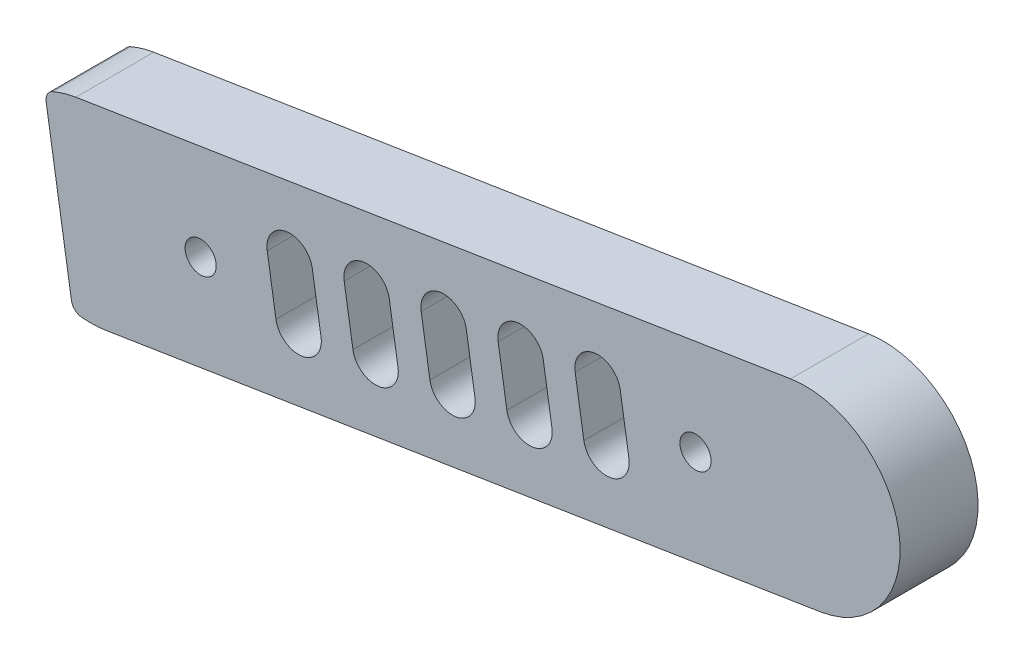
ISO-10303-21;
HEADER;
FILE_DESCRIPTION(('STEP AP214'),'2;1');
FILE_NAME('part.step','',(''),(''),'','','');
FILE_SCHEMA(('AUTOMOTIVE_DESIGN { 1 0 10303 214 1 1 1 1 }'));
ENDSEC;
DATA;
#1=APPLICATION_CONTEXT('core data for automotive mechanical design processes');
#2=APPLICATION_PROTOCOL_DEFINITION('international standard','automotive_design',2000,#1);
#3=PRODUCT_CONTEXT('',#1,'mechanical');
#4=PRODUCT('Part','Part','',(#3));
#5=PRODUCT_RELATED_PRODUCT_CATEGORY('part','',(#4));
#6=PRODUCT_DEFINITION_FORMATION('','',#4);
#7=PRODUCT_DEFINITION_CONTEXT('part definition',#1,'design');
#8=PRODUCT_DEFINITION('design','',#6,#7);
#9=PRODUCT_DEFINITION_SHAPE('','',#8);
#10=(LENGTH_UNIT() NAMED_UNIT(*) SI_UNIT(.MILLI.,.METRE.));
#11=(NAMED_UNIT(*) PLANE_ANGLE_UNIT() SI_UNIT($,.RADIAN.));
#12=(NAMED_UNIT(*) SI_UNIT($,.STERADIAN.) SOLID_ANGLE_UNIT());
#13=UNCERTAINTY_MEASURE_WITH_UNIT(LENGTH_MEASURE(1.E-05),#10,'distance_accuracy_value','');
#14=(GEOMETRIC_REPRESENTATION_CONTEXT(3) GLOBAL_UNCERTAINTY_ASSIGNED_CONTEXT((#13)) GLOBAL_UNIT_ASSIGNED_CONTEXT((#10,
#11,#12)) REPRESENTATION_CONTEXT('',''));
#15=CARTESIAN_POINT('',(0.,0.,0.));
#16=DIRECTION('',(0.,0.,1.));
#17=DIRECTION('',(1.,0.,0.));
#18=AXIS2_PLACEMENT_3D('',#15,#16,#17);
#19=CARTESIAN_POINT('',(-40.7231386420232,49.2227181202242,7.));
#20=DIRECTION('',(0.,0.,1.));
#21=DIRECTION('',(1.,0.,0.));
#22=AXIS2_PLACEMENT_3D('',#19,#20,#21);
#23=PLANE('',#22);
#24=CARTESIAN_POINT('',(-30.8468715609134,50.7909491435711,7.));
#25=DIRECTION('',(0.,0.,1.));
#26=DIRECTION('',(1.,0.,0.));
#27=AXIS2_PLACEMENT_3D('',#24,#25,#26);
#28=CIRCLE('',#27,1.4);
#29=CARTESIAN_POINT('',(-29.4468715609134,50.7909491435711,7.));
#30=VERTEX_POINT('',#29);
#31=EDGE_CURVE('E386',#30,#30,#28,.T.);
#32=ORIENTED_EDGE('',*,*,#31,.F.);
#33=EDGE_LOOP('',(#32));
#34=FACE_BOUND('',#33,.T.);
#35=CARTESIAN_POINT('',(-40.7231386420232,49.2227181202242,7.));
#36=DIRECTION('',(0.,0.,1.));
#37=DIRECTION('',(1.,0.,0.));
#38=AXIS2_PLACEMENT_3D('',#35,#36,#37);
#39=CIRCLE('',#38,8.49999999999936);
#40=CARTESIAN_POINT('',(-42.0561350118685,57.6175451391668,7.));
#41=VERTEX_POINT('',#40);
#42=CARTESIAN_POINT('',(-44.1393409125393,57.0060054749934,7.));
#43=VERTEX_POINT('',#42);
#44=EDGE_CURVE('E392',#41,#43,#39,.T.);
#45=ORIENTED_EDGE('',*,*,#44,.T.);
#46=CARTESIAN_POINT('',(-43.7374347630668,56.0903246097263,7.));
#47=DIRECTION('',(0.,0.,1.));
#48=DIRECTION('',(1.,0.,0.));
#49=AXIS2_PLACEMENT_3D('',#46,#47,#48);
#50=CIRCLE('',#49,1.00000000000001);
#51=CARTESIAN_POINT('',(-44.7250614711778,55.9335015073916,7.));
#52=VERTEX_POINT('',#51);
#53=EDGE_CURVE('E395',#43,#52,#50,.T.);
#54=ORIENTED_EDGE('',*,*,#53,.T.);
#55=DIRECTION('',(0.156823102334758,-0.987626708110965,0.));
#56=VECTOR('',#55,1.);
#57=CARTESIAN_POINT('',(-44.7250614711778,55.9335015073916,7.));
#58=LINE('',#57,#56);
#59=CARTESIAN_POINT('',(-42.4494507199119,41.602360739514,7.));
#60=VERTEX_POINT('',#59);
#61=EDGE_CURVE('E398',#52,#60,#58,.T.);
#62=ORIENTED_EDGE('',*,*,#61,.T.);
#63=CARTESIAN_POINT('',(-41.4618240118009,41.7591838418487,7.));
#64=DIRECTION('',(0.,0.,1.));
#65=DIRECTION('',(-1.,0.,0.));
#66=AXIS2_PLACEMENT_3D('',#63,#64,#65);
#67=CIRCLE('',#66,0.999999999999996);
#68=CARTESIAN_POINT('',(-41.560315394438,40.7640459380654,7.));
#69=VERTEX_POINT('',#68);
#70=EDGE_CURVE('E400',#60,#69,#67,.T.);
#71=ORIENTED_EDGE('',*,*,#70,.T.);
#72=CARTESIAN_POINT('',(-40.723138642023,49.2227181202194,7.));
#73=DIRECTION('',(0.,0.,1.));
#74=DIRECTION('',(-1.,0.,0.));
#75=AXIS2_PLACEMENT_3D('',#72,#73,#74);
#76=CIRCLE('',#75,8.49999999999588);
#77=CARTESIAN_POINT('',(-39.3901422721777,40.8278911012804,7.));
#78=VERTEX_POINT('',#77);
#79=EDGE_CURVE('E402',#69,#78,#76,.T.);
#80=ORIENTED_EDGE('',*,*,#79,.T.);
#81=DIRECTION('',(0.987626708110965,0.156823102334758,0.));
#82=VECTOR('',#81,1.);
#83=CARTESIAN_POINT('',(24.8055937550351,51.0213927530396,7.));
#84=LINE('',#83,#82);
#85=CARTESIAN_POINT('',(24.8055937550351,51.0213927530396,7.));
#86=VERTEX_POINT('',#85);
#87=EDGE_CURVE('E404',#78,#86,#84,.T.);
#88=ORIENTED_EDGE('',*,*,#87,.T.);
#89=CARTESIAN_POINT('',(23.4725973851897,59.4162197719828,7.));
#90=DIRECTION('',(0.,0.,1.));
#91=DIRECTION('',(-1.,0.,0.));
#92=AXIS2_PLACEMENT_3D('',#89,#90,#91);
#93=CIRCLE('',#92,8.50000000000001);
#94=CARTESIAN_POINT('',(22.1396010153443,67.811046790926,7.));
#95=VERTEX_POINT('',#94);
#96=EDGE_CURVE('E406',#86,#95,#93,.T.);
#97=ORIENTED_EDGE('',*,*,#96,.T.);
#98=DIRECTION('',(-0.987626708110965,-0.156823102334758,0.));
#99=VECTOR('',#98,1.);
#100=CARTESIAN_POINT('',(-42.0561350118685,57.6175451391668,7.));
#101=LINE('',#100,#99);
#102=EDGE_CURVE('E408',#95,#41,#101,.T.);
#103=ORIENTED_EDGE('',*,*,#102,.T.);
#104=EDGE_LOOP('',(#45,#54,#62,#71,#80,#88,#97,#103));
#105=FACE_BOUND('',#104,.T.);
#106=CARTESIAN_POINT('',(13.59633030408,57.8479887486353,7.));
#107=DIRECTION('',(0.,0.,1.));
#108=DIRECTION('',(1.,0.,0.));
#109=AXIS2_PLACEMENT_3D('',#106,#107,#108);
#110=CIRCLE('',#109,1.4);
#111=CARTESIAN_POINT('',(14.99633030408,57.8479887486353,7.));
#112=VERTEX_POINT('',#111);
#113=EDGE_CURVE('E380',#112,#112,#110,.T.);
#114=ORIENTED_EDGE('',*,*,#113,.F.);
#115=EDGE_LOOP('',(#114));
#116=FACE_BOUND('',#115,.T.);
#117=DIRECTION('',(0.156823102334757,-0.987626708110965,0.));
#118=VECTOR('',#117,1.);
#119=CARTESIAN_POINT('',(2.78481077766739,58.6625717892804,7.));
#120=LINE('',#119,#118);
#121=CARTESIAN_POINT('',(2.78481077766739,58.6625717892804,7.));
#122=VERTEX_POINT('',#121);
#123=CARTESIAN_POINT('',(3.56892628934118,53.7244382487256,7.));
#124=VERTEX_POINT('',#123);
#125=EDGE_CURVE('E351',#122,#124,#120,.T.);
#126=ORIENTED_EDGE('',*,*,#125,.F.);
#127=CARTESIAN_POINT('',(4.80944552929487,58.9840591490667,7.));
#128=DIRECTION('',(0.,0.,1.));
#129=DIRECTION('',(1.,0.,0.));
#130=AXIS2_PLACEMENT_3D('',#127,#128,#129);
#131=CIRCLE('',#130,2.05);
#132=CARTESIAN_POINT('',(6.83408028092235,59.305546508853,7.));
#133=VERTEX_POINT('',#132);
#134=EDGE_CURVE('E349',#133,#122,#131,.T.);
#135=ORIENTED_EDGE('',*,*,#134,.F.);
#136=DIRECTION('',(-0.156823102334755,0.987626708110966,0.));
#137=VECTOR('',#136,1.);
#138=CARTESIAN_POINT('',(6.83408028092235,59.305546508853,7.));
#139=LINE('',#138,#137);
#140=CARTESIAN_POINT('',(7.61819579259613,54.3674129682981,7.));
#141=VERTEX_POINT('',#140);
#142=EDGE_CURVE('E357',#141,#133,#139,.T.);
#143=ORIENTED_EDGE('',*,*,#142,.F.);
#144=CARTESIAN_POINT('',(5.59356104096865,54.0459256085119,7.));
#145=DIRECTION('',(0.,0.,1.));
#146=DIRECTION('',(1.,0.,0.));
#147=AXIS2_PLACEMENT_3D('',#144,#145,#146);
#148=CIRCLE('',#147,2.05);
#149=EDGE_CURVE('E354',#124,#141,#148,.T.);
#150=ORIENTED_EDGE('',*,*,#149,.F.);
#151=EDGE_LOOP('',(#126,#135,#143,#150));
#152=FACE_BOUND('',#151,.T.);
#153=DIRECTION('',(0.156823102334757,-0.987626708110965,0.));
#154=VECTOR('',#153,1.);
#155=CARTESIAN_POINT('',(-4.12857617910944,57.5648100729376,7.));
#156=LINE('',#155,#154);
#157=CARTESIAN_POINT('',(-4.12857617910944,57.5648100729376,7.));
#158=VERTEX_POINT('',#157);
#159=CARTESIAN_POINT('',(-3.34446066743565,52.6266765323828,7.));
#160=VERTEX_POINT('',#159);
#161=EDGE_CURVE('E320',#158,#160,#156,.T.);
#162=ORIENTED_EDGE('',*,*,#161,.F.);
#163=CARTESIAN_POINT('',(-2.10394142748196,57.8862974327238,7.));
#164=DIRECTION('',(0.,0.,1.));
#165=DIRECTION('',(1.,0.,0.));
#166=AXIS2_PLACEMENT_3D('',#163,#164,#165);
#167=CIRCLE('',#166,2.05);
#168=CARTESIAN_POINT('',(-0.0793066758544752,58.2077847925101,7.));
#169=VERTEX_POINT('',#168);
#170=EDGE_CURVE('E318',#169,#158,#167,.T.);
#171=ORIENTED_EDGE('',*,*,#170,.F.);
#172=DIRECTION('',(-0.156823102334755,0.987626708110966,0.));
#173=VECTOR('',#172,1.);
#174=CARTESIAN_POINT('',(-0.0793066758544752,58.2077847925101,7.));
#175=LINE('',#174,#173);
#176=CARTESIAN_POINT('',(0.704808835819294,53.2696512519553,7.));
#177=VERTEX_POINT('',#176);
#178=EDGE_CURVE('E326',#177,#169,#175,.T.);
#179=ORIENTED_EDGE('',*,*,#178,.F.);
#180=CARTESIAN_POINT('',(-1.31982591580818,52.948163892169,7.));
#181=DIRECTION('',(0.,0.,1.));
#182=DIRECTION('',(1.,0.,0.));
#183=AXIS2_PLACEMENT_3D('',#180,#181,#182);
#184=CIRCLE('',#183,2.05);
#185=EDGE_CURVE('E323',#160,#177,#184,.T.);
#186=ORIENTED_EDGE('',*,*,#185,.F.);
#187=EDGE_LOOP('',(#162,#171,#179,#186));
#188=FACE_BOUND('',#187,.T.);
#189=DIRECTION('',(0.156823102334757,-0.987626708110965,0.));
#190=VECTOR('',#189,1.);
#191=CARTESIAN_POINT('',(-11.0419631358863,56.4670483565948,7.));
#192=LINE('',#191,#190);
#193=CARTESIAN_POINT('',(-11.0419631358863,56.4670483565948,7.));
#194=VERTEX_POINT('',#193);
#195=CARTESIAN_POINT('',(-10.2578476242125,51.5289148160399,7.));
#196=VERTEX_POINT('',#195);
#197=EDGE_CURVE('E289',#194,#196,#192,.T.);
#198=ORIENTED_EDGE('',*,*,#197,.F.);
#199=CARTESIAN_POINT('',(-9.01732838425879,56.788535716381,7.));
#200=DIRECTION('',(0.,0.,1.));
#201=DIRECTION('',(1.,0.,0.));
#202=AXIS2_PLACEMENT_3D('',#199,#200,#201);
#203=CIRCLE('',#202,2.05);
#204=CARTESIAN_POINT('',(-6.99269363263131,57.1100230761673,7.));
#205=VERTEX_POINT('',#204);
#206=EDGE_CURVE('E287',#205,#194,#203,.T.);
#207=ORIENTED_EDGE('',*,*,#206,.F.);
#208=DIRECTION('',(-0.156823102334755,0.987626708110966,0.));
#209=VECTOR('',#208,1.);
#210=CARTESIAN_POINT('',(-6.99269363263131,57.1100230761673,7.));
#211=LINE('',#210,#209);
#212=CARTESIAN_POINT('',(-6.20857812095753,52.1718895356124,7.));
#213=VERTEX_POINT('',#212);
#214=EDGE_CURVE('E295',#213,#205,#211,.T.);
#215=ORIENTED_EDGE('',*,*,#214,.F.);
#216=CARTESIAN_POINT('',(-8.23321287258501,51.8504021758262,7.));
#217=DIRECTION('',(0.,0.,1.));
#218=DIRECTION('',(1.,0.,0.));
#219=AXIS2_PLACEMENT_3D('',#216,#217,#218);
#220=CIRCLE('',#219,2.05);
#221=EDGE_CURVE('E292',#196,#213,#220,.T.);
#222=ORIENTED_EDGE('',*,*,#221,.F.);
#223=EDGE_LOOP('',(#198,#207,#215,#222));
#224=FACE_BOUND('',#223,.T.);
#225=DIRECTION('',(0.156823102334757,-0.987626708110965,0.));
#226=VECTOR('',#225,1.);
#227=CARTESIAN_POINT('',(-17.9553500926631,55.3692866402519,7.));
#228=LINE('',#227,#226);
#229=CARTESIAN_POINT('',(-17.9553500926631,55.3692866402519,7.));
#230=VERTEX_POINT('',#229);
#231=CARTESIAN_POINT('',(-17.1712345809893,50.4311530996971,7.));
#232=VERTEX_POINT('',#231);
#233=EDGE_CURVE('E258',#230,#232,#228,.T.);
#234=ORIENTED_EDGE('',*,*,#233,.F.);
#235=CARTESIAN_POINT('',(-15.9307153410356,55.6907740000381,7.));
#236=DIRECTION('',(0.,0.,1.));
#237=DIRECTION('',(1.,0.,0.));
#238=AXIS2_PLACEMENT_3D('',#235,#236,#237);
#239=CIRCLE('',#238,2.05);
#240=CARTESIAN_POINT('',(-13.9060805894081,56.0122613598244,7.));
#241=VERTEX_POINT('',#240);
#242=EDGE_CURVE('E256',#241,#230,#239,.T.);
#243=ORIENTED_EDGE('',*,*,#242,.F.);
#244=DIRECTION('',(-0.156823102334755,0.987626708110966,0.));
#245=VECTOR('',#244,1.);
#246=CARTESIAN_POINT('',(-13.9060805894081,56.0122613598244,7.));
#247=LINE('',#246,#245);
#248=CARTESIAN_POINT('',(-13.1219650777344,51.0741278192696,7.));
#249=VERTEX_POINT('',#248);
#250=EDGE_CURVE('E264',#249,#241,#247,.T.);
#251=ORIENTED_EDGE('',*,*,#250,.F.);
#252=CARTESIAN_POINT('',(-15.1465998293618,50.7526404594833,7.));
#253=DIRECTION('',(0.,0.,1.));
#254=DIRECTION('',(1.,0.,0.));
#255=AXIS2_PLACEMENT_3D('',#252,#253,#254);
#256=CIRCLE('',#255,2.05);
#257=EDGE_CURVE('E261',#232,#249,#256,.T.);
#258=ORIENTED_EDGE('',*,*,#257,.F.);
#259=EDGE_LOOP('',(#234,#243,#251,#258));
#260=FACE_BOUND('',#259,.T.);
#261=DIRECTION('',(0.156823102334757,-0.987626708110965,0.));
#262=VECTOR('',#261,1.);
#263=CARTESIAN_POINT('',(-24.8687370494399,54.2715249239091,7.));
#264=LINE('',#263,#262);
#265=CARTESIAN_POINT('',(-24.8687370494399,54.2715249239091,7.));
#266=VERTEX_POINT('',#265);
#267=CARTESIAN_POINT('',(-24.0846215377661,49.3333913833542,7.));
#268=VERTEX_POINT('',#267);
#269=EDGE_CURVE('E228',#266,#268,#264,.T.);
#270=ORIENTED_EDGE('',*,*,#269,.F.);
#271=CARTESIAN_POINT('',(-22.8441022978124,54.5930122836953,7.));
#272=DIRECTION('',(0.,0.,1.));
#273=DIRECTION('',(1.,0.,0.));
#274=AXIS2_PLACEMENT_3D('',#271,#272,#273);
#275=CIRCLE('',#274,2.05);
#276=CARTESIAN_POINT('',(-20.819467546185,54.9144996434816,7.));
#277=VERTEX_POINT('',#276);
#278=EDGE_CURVE('E220',#277,#266,#275,.T.);
#279=ORIENTED_EDGE('',*,*,#278,.F.);
#280=DIRECTION('',(-0.156823102334755,0.987626708110966,0.));
#281=VECTOR('',#280,1.);
#282=CARTESIAN_POINT('',(-20.819467546185,54.9144996434816,7.));
#283=LINE('',#282,#281);
#284=CARTESIAN_POINT('',(-20.0353520345112,49.9763661029267,7.));
#285=VERTEX_POINT('',#284);
#286=EDGE_CURVE('E242',#285,#277,#283,.T.);
#287=ORIENTED_EDGE('',*,*,#286,.F.);
#288=CARTESIAN_POINT('',(-22.0599867861387,49.6548787431405,7.));
#289=DIRECTION('',(0.,0.,1.));
#290=DIRECTION('',(1.,0.,0.));
#291=AXIS2_PLACEMENT_3D('',#288,#289,#290);
#292=CIRCLE('',#291,2.05);
#293=EDGE_CURVE('E240',#268,#285,#292,.T.);
#294=ORIENTED_EDGE('',*,*,#293,.F.);
#295=EDGE_LOOP('',(#270,#279,#287,#294));
#296=FACE_BOUND('',#295,.T.);
#297=ADVANCED_FACE('F35',(#34,#105,#116,#152,#188,#224,#260,#296),#23,.T.);
#298=CARTESIAN_POINT('',(-40.7231386420232,49.2227181202242,0.));
#299=DIRECTION('',(0.,0.,1.));
#300=DIRECTION('',(1.,0.,0.));
#301=AXIS2_PLACEMENT_3D('',#298,#299,#300);
#302=PLANE('',#301);
#303=CARTESIAN_POINT('',(-15.9307153410356,55.6907740000381,0.));
#304=DIRECTION('',(0.,0.,1.));
#305=DIRECTION('',(1.,0.,0.));
#306=AXIS2_PLACEMENT_3D('',#303,#304,#305);
#307=CIRCLE('',#306,2.05);
#308=CARTESIAN_POINT('',(-13.9060805894081,56.0122613598244,0.));
#309=VERTEX_POINT('',#308);
#310=CARTESIAN_POINT('',(-17.9553500926631,55.3692866402519,0.));
#311=VERTEX_POINT('',#310);
#312=EDGE_CURVE('E236',#309,#311,#307,.T.);
#313=ORIENTED_EDGE('',*,*,#312,.T.);
#314=DIRECTION('',(0.156823102334757,-0.987626708110965,0.));
#315=VECTOR('',#314,1.);
#316=CARTESIAN_POINT('',(-17.9553500926631,55.3692866402519,0.));
#317=LINE('',#316,#315);
#318=CARTESIAN_POINT('',(-17.1712345809893,50.4311530996971,0.));
#319=VERTEX_POINT('',#318);
#320=EDGE_CURVE('E269',#311,#319,#317,.T.);
#321=ORIENTED_EDGE('',*,*,#320,.T.);
#322=CARTESIAN_POINT('',(-15.1465998293618,50.7526404594833,0.));
#323=DIRECTION('',(0.,0.,1.));
#324=DIRECTION('',(1.,0.,0.));
#325=AXIS2_PLACEMENT_3D('',#322,#323,#324);
#326=CIRCLE('',#325,2.05);
#327=CARTESIAN_POINT('',(-13.1219650777344,51.0741278192696,0.));
#328=VERTEX_POINT('',#327);
#329=EDGE_CURVE('E272',#319,#328,#326,.T.);
#330=ORIENTED_EDGE('',*,*,#329,.T.);
#331=DIRECTION('',(-0.156823102334755,0.987626708110966,0.));
#332=VECTOR('',#331,1.);
#333=CARTESIAN_POINT('',(-13.9060805894081,56.0122613598244,0.));
#334=LINE('',#333,#332);
#335=EDGE_CURVE('E259',#328,#309,#334,.T.);
#336=ORIENTED_EDGE('',*,*,#335,.T.);
#337=EDGE_LOOP('',(#313,#321,#330,#336));
#338=FACE_BOUND('',#337,.T.);
#339=CARTESIAN_POINT('',(-2.10394142748196,57.8862974327238,0.));
#340=DIRECTION('',(0.,0.,1.));
#341=DIRECTION('',(1.,0.,0.));
#342=AXIS2_PLACEMENT_3D('',#339,#340,#341);
#343=CIRCLE('',#342,2.05);
#344=CARTESIAN_POINT('',(-0.079306675854479,58.2077847925101,0.));
#345=VERTEX_POINT('',#344);
#346=CARTESIAN_POINT('',(-4.12857617910944,57.5648100729376,0.));
#347=VERTEX_POINT('',#346);
#348=EDGE_CURVE('E317',#345,#347,#343,.T.);
#349=ORIENTED_EDGE('',*,*,#348,.T.);
#350=DIRECTION('',(0.156823102334757,-0.987626708110965,0.));
#351=VECTOR('',#350,1.);
#352=CARTESIAN_POINT('',(-4.12857617910944,57.5648100729376,0.));
#353=LINE('',#352,#351);
#354=CARTESIAN_POINT('',(-3.34446066743565,52.6266765323828,0.));
#355=VERTEX_POINT('',#354);
#356=EDGE_CURVE('E331',#347,#355,#353,.T.);
#357=ORIENTED_EDGE('',*,*,#356,.T.);
#358=CARTESIAN_POINT('',(-1.31982591580818,52.948163892169,0.));
#359=DIRECTION('',(0.,0.,1.));
#360=DIRECTION('',(1.,0.,0.));
#361=AXIS2_PLACEMENT_3D('',#358,#359,#360);
#362=CIRCLE('',#361,2.05);
#363=CARTESIAN_POINT('',(0.704808835819297,53.2696512519553,0.));
#364=VERTEX_POINT('',#363);
#365=EDGE_CURVE('E334',#355,#364,#362,.T.);
#366=ORIENTED_EDGE('',*,*,#365,.T.);
#367=DIRECTION('',(-0.156823102334755,0.987626708110966,0.));
#368=VECTOR('',#367,1.);
#369=CARTESIAN_POINT('',(-0.0793066758544752,58.2077847925101,0.));
#370=LINE('',#369,#368);
#371=EDGE_CURVE('E321',#364,#345,#370,.T.);
#372=ORIENTED_EDGE('',*,*,#371,.T.);
#373=EDGE_LOOP('',(#349,#357,#366,#372));
#374=FACE_BOUND('',#373,.T.);
#375=CARTESIAN_POINT('',(13.59633030408,57.8479887486353,0.));
#376=DIRECTION('',(0.,0.,1.));
#377=DIRECTION('',(1.,0.,0.));
#378=AXIS2_PLACEMENT_3D('',#375,#376,#377);
#379=CIRCLE('',#378,1.4);
#380=CARTESIAN_POINT('',(14.99633030408,57.8479887486353,0.));
#381=VERTEX_POINT('',#380);
#382=EDGE_CURVE('E379',#381,#381,#379,.T.);
#383=ORIENTED_EDGE('',*,*,#382,.T.);
#384=EDGE_LOOP('',(#383));
#385=FACE_BOUND('',#384,.T.);
#386=CARTESIAN_POINT('',(-30.8468715609134,50.7909491435711,0.));
#387=DIRECTION('',(0.,0.,1.));
#388=DIRECTION('',(1.,0.,0.));
#389=AXIS2_PLACEMENT_3D('',#386,#387,#388);
#390=CIRCLE('',#389,1.4);
#391=CARTESIAN_POINT('',(-29.4468715609134,50.7909491435711,0.));
#392=VERTEX_POINT('',#391);
#393=EDGE_CURVE('E383',#392,#392,#390,.T.);
#394=ORIENTED_EDGE('',*,*,#393,.T.);
#395=EDGE_LOOP('',(#394));
#396=FACE_BOUND('',#395,.T.);
#397=CARTESIAN_POINT('',(-40.7231386420232,49.2227181202242,0.));
#398=DIRECTION('',(0.,0.,1.));
#399=DIRECTION('',(1.,0.,0.));
#400=AXIS2_PLACEMENT_3D('',#397,#398,#399);
#401=CIRCLE('',#400,8.49999999999936);
#402=CARTESIAN_POINT('',(-42.0561350118685,57.6175451391668,0.));
#403=VERTEX_POINT('',#402);
#404=CARTESIAN_POINT('',(-44.1393409125393,57.0060054749934,0.));
#405=VERTEX_POINT('',#404);
#406=EDGE_CURVE('E389',#403,#405,#401,.T.);
#407=ORIENTED_EDGE('',*,*,#406,.F.);
#408=DIRECTION('',(-0.987626708110965,-0.156823102334758,0.));
#409=VECTOR('',#408,1.);
#410=CARTESIAN_POINT('',(-42.0561350118685,57.6175451391668,0.));
#411=LINE('',#410,#409);
#412=CARTESIAN_POINT('',(22.1396010153443,67.811046790926,0.));
#413=VERTEX_POINT('',#412);
#414=EDGE_CURVE('E396',#413,#403,#411,.T.);
#415=ORIENTED_EDGE('',*,*,#414,.F.);
#416=CARTESIAN_POINT('',(23.4725973851897,59.4162197719828,0.));
#417=DIRECTION('',(0.,0.,1.));
#418=DIRECTION('',(-1.,0.,0.));
#419=AXIS2_PLACEMENT_3D('',#416,#417,#418);
#420=CIRCLE('',#419,8.50000000000001);
#421=CARTESIAN_POINT('',(24.8055937550351,51.0213927530396,0.));
#422=VERTEX_POINT('',#421);
#423=EDGE_CURVE('E423',#422,#413,#420,.T.);
#424=ORIENTED_EDGE('',*,*,#423,.F.);
#425=DIRECTION('',(0.987626708110965,0.156823102334758,0.));
#426=VECTOR('',#425,1.);
#427=CARTESIAN_POINT('',(24.8055937550351,51.0213927530396,0.));
#428=LINE('',#427,#426);
#429=CARTESIAN_POINT('',(-39.3901422721777,40.8278911012804,0.));
#430=VERTEX_POINT('',#429);
#431=EDGE_CURVE('E421',#430,#422,#428,.T.);
#432=ORIENTED_EDGE('',*,*,#431,.F.);
#433=CARTESIAN_POINT('',(-40.723138642023,49.2227181202194,0.));
#434=DIRECTION('',(0.,0.,1.));
#435=DIRECTION('',(-1.,0.,0.));
#436=AXIS2_PLACEMENT_3D('',#433,#434,#435);
#437=CIRCLE('',#436,8.49999999999588);
#438=CARTESIAN_POINT('',(-41.560315394438,40.7640459380654,0.));
#439=VERTEX_POINT('',#438);
#440=EDGE_CURVE('E419',#439,#430,#437,.T.);
#441=ORIENTED_EDGE('',*,*,#440,.F.);
#442=CARTESIAN_POINT('',(-41.4618240118009,41.7591838418487,0.));
#443=DIRECTION('',(0.,0.,1.));
#444=DIRECTION('',(-1.,0.,0.));
#445=AXIS2_PLACEMENT_3D('',#442,#443,#444);
#446=CIRCLE('',#445,0.999999999999996);
#447=CARTESIAN_POINT('',(-42.4494507199119,41.602360739514,0.));
#448=VERTEX_POINT('',#447);
#449=EDGE_CURVE('E417',#448,#439,#446,.T.);
#450=ORIENTED_EDGE('',*,*,#449,.F.);
#451=DIRECTION('',(0.156823102334758,-0.987626708110965,0.));
#452=VECTOR('',#451,1.);
#453=CARTESIAN_POINT('',(-44.7250614711778,55.9335015073916,0.));
#454=LINE('',#453,#452);
#455=CARTESIAN_POINT('',(-44.7250614711778,55.9335015073916,0.));
#456=VERTEX_POINT('',#455);
#457=EDGE_CURVE('E415',#456,#448,#454,.T.);
#458=ORIENTED_EDGE('',*,*,#457,.F.);
#459=CARTESIAN_POINT('',(-43.7374347630668,56.0903246097263,0.));
#460=DIRECTION('',(0.,0.,1.));
#461=DIRECTION('',(1.,0.,0.));
#462=AXIS2_PLACEMENT_3D('',#459,#460,#461);
#463=CIRCLE('',#462,1.00000000000001);
#464=EDGE_CURVE('E413',#405,#456,#463,.T.);
#465=ORIENTED_EDGE('',*,*,#464,.F.);
#466=EDGE_LOOP('',(#407,#415,#424,#432,#441,#450,#458,#465));
#467=FACE_BOUND('',#466,.T.);
#468=CARTESIAN_POINT('',(4.80944552929487,58.9840591490667,0.));
#469=DIRECTION('',(0.,0.,1.));
#470=DIRECTION('',(1.,0.,0.));
#471=AXIS2_PLACEMENT_3D('',#468,#469,#470);
#472=CIRCLE('',#471,2.05);
#473=CARTESIAN_POINT('',(6.83408028092235,59.305546508853,0.));
#474=VERTEX_POINT('',#473);
#475=CARTESIAN_POINT('',(2.78481077766739,58.6625717892804,0.));
#476=VERTEX_POINT('',#475);
#477=EDGE_CURVE('E348',#474,#476,#472,.T.);
#478=ORIENTED_EDGE('',*,*,#477,.T.);
#479=DIRECTION('',(0.156823102334757,-0.987626708110965,0.));
#480=VECTOR('',#479,1.);
#481=CARTESIAN_POINT('',(2.78481077766739,58.6625717892804,0.));
#482=LINE('',#481,#480);
#483=CARTESIAN_POINT('',(3.56892628934118,53.7244382487256,0.));
#484=VERTEX_POINT('',#483);
#485=EDGE_CURVE('E362',#476,#484,#482,.T.);
#486=ORIENTED_EDGE('',*,*,#485,.T.);
#487=CARTESIAN_POINT('',(5.59356104096865,54.0459256085119,0.));
#488=DIRECTION('',(0.,0.,1.));
#489=DIRECTION('',(1.,0.,0.));
#490=AXIS2_PLACEMENT_3D('',#487,#488,#489);
#491=CIRCLE('',#490,2.05);
#492=CARTESIAN_POINT('',(7.61819579259613,54.3674129682981,0.));
#493=VERTEX_POINT('',#492);
#494=EDGE_CURVE('E365',#484,#493,#491,.T.);
#495=ORIENTED_EDGE('',*,*,#494,.T.);
#496=DIRECTION('',(-0.156823102334755,0.987626708110966,0.));
#497=VECTOR('',#496,1.);
#498=CARTESIAN_POINT('',(6.83408028092235,59.305546508853,0.));
#499=LINE('',#498,#497);
#500=EDGE_CURVE('E352',#493,#474,#499,.T.);
#501=ORIENTED_EDGE('',*,*,#500,.T.);
#502=EDGE_LOOP('',(#478,#486,#495,#501));
#503=FACE_BOUND('',#502,.T.);
#504=CARTESIAN_POINT('',(-9.01732838425879,56.788535716381,0.));
#505=DIRECTION('',(0.,0.,1.));
#506=DIRECTION('',(1.,0.,0.));
#507=AXIS2_PLACEMENT_3D('',#504,#505,#506);
#508=CIRCLE('',#507,2.05);
#509=CARTESIAN_POINT('',(-6.9926936326313,57.1100230761673,0.));
#510=VERTEX_POINT('',#509);
#511=CARTESIAN_POINT('',(-11.0419631358863,56.4670483565948,0.));
#512=VERTEX_POINT('',#511);
#513=EDGE_CURVE('E286',#510,#512,#508,.T.);
#514=ORIENTED_EDGE('',*,*,#513,.T.);
#515=DIRECTION('',(0.156823102334757,-0.987626708110965,0.));
#516=VECTOR('',#515,1.);
#517=CARTESIAN_POINT('',(-11.0419631358863,56.4670483565948,0.));
#518=LINE('',#517,#516);
#519=CARTESIAN_POINT('',(-10.2578476242125,51.5289148160399,0.));
#520=VERTEX_POINT('',#519);
#521=EDGE_CURVE('E300',#512,#520,#518,.T.);
#522=ORIENTED_EDGE('',*,*,#521,.T.);
#523=CARTESIAN_POINT('',(-8.23321287258501,51.8504021758262,0.));
#524=DIRECTION('',(0.,0.,1.));
#525=DIRECTION('',(1.,0.,0.));
#526=AXIS2_PLACEMENT_3D('',#523,#524,#525);
#527=CIRCLE('',#526,2.05);
#528=CARTESIAN_POINT('',(-6.20857812095753,52.1718895356124,0.));
#529=VERTEX_POINT('',#528);
#530=EDGE_CURVE('E303',#520,#529,#527,.T.);
#531=ORIENTED_EDGE('',*,*,#530,.T.);
#532=DIRECTION('',(-0.156823102334755,0.987626708110966,0.));
#533=VECTOR('',#532,1.);
#534=CARTESIAN_POINT('',(-6.99269363263131,57.1100230761673,0.));
#535=LINE('',#534,#533);
#536=EDGE_CURVE('E290',#529,#510,#535,.T.);
#537=ORIENTED_EDGE('',*,*,#536,.T.);
#538=EDGE_LOOP('',(#514,#522,#531,#537));
#539=FACE_BOUND('',#538,.T.);
#540=CARTESIAN_POINT('',(-22.8441022978124,54.5930122836953,0.));
#541=DIRECTION('',(0.,0.,1.));
#542=DIRECTION('',(1.,0.,0.));
#543=AXIS2_PLACEMENT_3D('',#540,#541,#542);
#544=CIRCLE('',#543,2.05);
#545=CARTESIAN_POINT('',(-20.819467546185,54.9144996434816,0.));
#546=VERTEX_POINT('',#545);
#547=CARTESIAN_POINT('',(-24.8687370494399,54.2715249239091,0.));
#548=VERTEX_POINT('',#547);
#549=EDGE_CURVE('E58',#546,#548,#544,.T.);
#550=ORIENTED_EDGE('',*,*,#549,.T.);
#551=DIRECTION('',(0.156823102334757,-0.987626708110965,0.));
#552=VECTOR('',#551,1.);
#553=CARTESIAN_POINT('',(-24.8687370494399,54.2715249239091,0.));
#554=LINE('',#553,#552);
#555=CARTESIAN_POINT('',(-24.0846215377661,49.3333913833542,0.));
#556=VERTEX_POINT('',#555);
#557=EDGE_CURVE('E235',#548,#556,#554,.T.);
#558=ORIENTED_EDGE('',*,*,#557,.T.);
#559=CARTESIAN_POINT('',(-22.0599867861387,49.6548787431405,0.));
#560=DIRECTION('',(0.,0.,1.));
#561=DIRECTION('',(1.,0.,0.));
#562=AXIS2_PLACEMENT_3D('',#559,#560,#561);
#563=CIRCLE('',#562,2.05);
#564=CARTESIAN_POINT('',(-20.0353520345112,49.9763661029267,0.));
#565=VERTEX_POINT('',#564);
#566=EDGE_CURVE('E248',#556,#565,#563,.T.);
#567=ORIENTED_EDGE('',*,*,#566,.T.);
#568=DIRECTION('',(-0.156823102334755,0.987626708110966,0.));
#569=VECTOR('',#568,1.);
#570=CARTESIAN_POINT('',(-20.819467546185,54.9144996434816,0.));
#571=LINE('',#570,#569);
#572=EDGE_CURVE('E229',#565,#546,#571,.T.);
#573=ORIENTED_EDGE('',*,*,#572,.T.);
#574=EDGE_LOOP('',(#550,#558,#567,#573));
#575=FACE_BOUND('',#574,.T.);
#576=ADVANCED_FACE('F453',(#338,#374,#385,#396,#467,#503,#539,#575),#302,.F.);
#577=CARTESIAN_POINT('',(-40.7231386420232,49.2227181202242,7.));
#578=DIRECTION('',(0.,0.,-1.));
#579=DIRECTION('',(-1.,0.,0.));
#580=AXIS2_PLACEMENT_3D('',#577,#578,#579);
#581=CYLINDRICAL_SURFACE('',#580,8.49999999999936);
#582=ORIENTED_EDGE('',*,*,#406,.T.);
#583=DIRECTION('',(0.,0.,-1.));
#584=VECTOR('',#583,1.);
#585=CARTESIAN_POINT('',(-44.1393409125393,57.0060054749934,7.));
#586=LINE('',#585,#584);
#587=EDGE_CURVE('E11',#43,#405,#586,.T.);
#588=ORIENTED_EDGE('',*,*,#587,.F.);
#589=ORIENTED_EDGE('',*,*,#44,.F.);
#590=DIRECTION('',(0.,0.,-1.));
#591=VECTOR('',#590,1.);
#592=CARTESIAN_POINT('',(-42.0561350118685,57.6175451391668,7.));
#593=LINE('',#592,#591);
#594=EDGE_CURVE('E410',#41,#403,#593,.T.);
#595=ORIENTED_EDGE('',*,*,#594,.T.);
#596=EDGE_LOOP('',(#582,#588,#589,#595));
#597=FACE_BOUND('',#596,.T.);
#598=ADVANCED_FACE('F37',(#597),#581,.T.);
#599=CARTESIAN_POINT('',(-43.7374347630668,56.0903246097263,7.));
#600=DIRECTION('',(0.,0.,-1.));
#601=DIRECTION('',(-1.,0.,0.));
#602=AXIS2_PLACEMENT_3D('',#599,#600,#601);
#603=CYLINDRICAL_SURFACE('',#602,1.00000000000001);
#604=ORIENTED_EDGE('',*,*,#464,.T.);
#605=DIRECTION('',(0.,0.,-1.));
#606=VECTOR('',#605,1.);
#607=CARTESIAN_POINT('',(-44.7250614711778,55.9335015073916,7.));
#608=LINE('',#607,#606);
#609=EDGE_CURVE('E43',#52,#456,#608,.T.);
#610=ORIENTED_EDGE('',*,*,#609,.F.);
#611=ORIENTED_EDGE('',*,*,#53,.F.);
#612=ORIENTED_EDGE('',*,*,#587,.T.);
#613=EDGE_LOOP('',(#604,#610,#611,#612));
#614=FACE_BOUND('',#613,.T.);
#615=ADVANCED_FACE('F471',(#614),#603,.T.);
#616=CARTESIAN_POINT('',(-44.7250614711778,55.9335015073916,7.));
#617=DIRECTION('',(0.987626708110965,0.156823102334758,0.));
#618=DIRECTION('',(-0.156823102334758,0.987626708110966,0.));
#619=AXIS2_PLACEMENT_3D('',#616,#617,#618);
#620=PLANE('',#619);
#621=ORIENTED_EDGE('',*,*,#457,.T.);
#622=DIRECTION('',(0.,0.,-1.));
#623=VECTOR('',#622,1.);
#624=CARTESIAN_POINT('',(-42.4494507199119,41.602360739514,7.));
#625=LINE('',#624,#623);
#626=EDGE_CURVE('E440',#60,#448,#625,.T.);
#627=ORIENTED_EDGE('',*,*,#626,.F.);
#628=ORIENTED_EDGE('',*,*,#61,.F.);
#629=ORIENTED_EDGE('',*,*,#609,.T.);
#630=EDGE_LOOP('',(#621,#627,#628,#629));
#631=FACE_BOUND('',#630,.T.);
#632=ADVANCED_FACE('F447',(#631),#620,.F.);
#633=CARTESIAN_POINT('',(-41.4618240118009,41.7591838418487,7.));
#634=DIRECTION('',(0.,0.,-1.));
#635=DIRECTION('',(-1.,0.,0.));
#636=AXIS2_PLACEMENT_3D('',#633,#634,#635);
#637=CYLINDRICAL_SURFACE('',#636,0.999999999999996);
#638=ORIENTED_EDGE('',*,*,#449,.T.);
#639=DIRECTION('',(0.,0.,-1.));
#640=VECTOR('',#639,1.);
#641=CARTESIAN_POINT('',(-41.560315394438,40.7640459380654,7.));
#642=LINE('',#641,#640);
#643=EDGE_CURVE('E437',#69,#439,#642,.T.);
#644=ORIENTED_EDGE('',*,*,#643,.F.);
#645=ORIENTED_EDGE('',*,*,#70,.F.);
#646=ORIENTED_EDGE('',*,*,#626,.T.);
#647=EDGE_LOOP('',(#638,#644,#645,#646));
#648=FACE_BOUND('',#647,.T.);
#649=ADVANCED_FACE('F459',(#648),#637,.T.);
#650=CARTESIAN_POINT('',(-40.723138642023,49.2227181202194,7.));
#651=DIRECTION('',(0.,0.,-1.));
#652=DIRECTION('',(-1.,0.,0.));
#653=AXIS2_PLACEMENT_3D('',#650,#651,#652);
#654=CYLINDRICAL_SURFACE('',#653,8.49999999999588);
#655=ORIENTED_EDGE('',*,*,#440,.T.);
#656=DIRECTION('',(0.,0.,-1.));
#657=VECTOR('',#656,1.);
#658=CARTESIAN_POINT('',(-39.3901422721777,40.8278911012804,7.));
#659=LINE('',#658,#657);
#660=EDGE_CURVE('E434',#78,#430,#659,.T.);
#661=ORIENTED_EDGE('',*,*,#660,.F.);
#662=ORIENTED_EDGE('',*,*,#79,.F.);
#663=ORIENTED_EDGE('',*,*,#643,.T.);
#664=EDGE_LOOP('',(#655,#661,#662,#663));
#665=FACE_BOUND('',#664,.T.);
#666=ADVANCED_FACE('F463',(#665),#654,.T.);
#667=CARTESIAN_POINT('',(24.8055937550351,51.0213927530396,7.));
#668=DIRECTION('',(-0.156823102334758,0.987626708110965,0.));
#669=DIRECTION('',(-0.987626708110966,-0.156823102334758,0.));
#670=AXIS2_PLACEMENT_3D('',#667,#668,#669);
#671=PLANE('',#670);
#672=ORIENTED_EDGE('',*,*,#431,.T.);
#673=DIRECTION('',(0.,0.,-1.));
#674=VECTOR('',#673,1.);
#675=CARTESIAN_POINT('',(24.8055937550351,51.0213927530396,7.));
#676=LINE('',#675,#674);
#677=EDGE_CURVE('E431',#86,#422,#676,.T.);
#678=ORIENTED_EDGE('',*,*,#677,.F.);
#679=ORIENTED_EDGE('',*,*,#87,.F.);
#680=ORIENTED_EDGE('',*,*,#660,.T.);
#681=EDGE_LOOP('',(#672,#678,#679,#680));
#682=FACE_BOUND('',#681,.T.);
#683=ADVANCED_FACE('F484',(#682),#671,.F.);
#684=CARTESIAN_POINT('',(23.4725973851897,59.4162197719828,7.));
#685=DIRECTION('',(0.,0.,-1.));
#686=DIRECTION('',(-1.,0.,0.));
#687=AXIS2_PLACEMENT_3D('',#684,#685,#686);
#688=CYLINDRICAL_SURFACE('',#687,8.50000000000001);
#689=ORIENTED_EDGE('',*,*,#423,.T.);
#690=DIRECTION('',(0.,0.,-1.));
#691=VECTOR('',#690,1.);
#692=CARTESIAN_POINT('',(22.1396010153443,67.811046790926,7.));
#693=LINE('',#692,#691);
#694=EDGE_CURVE('E428',#95,#413,#693,.T.);
#695=ORIENTED_EDGE('',*,*,#694,.F.);
#696=ORIENTED_EDGE('',*,*,#96,.F.);
#697=ORIENTED_EDGE('',*,*,#677,.T.);
#698=EDGE_LOOP('',(#689,#695,#696,#697));
#699=FACE_BOUND('',#698,.T.);
#700=ADVANCED_FACE('F482',(#699),#688,.T.);
#701=CARTESIAN_POINT('',(-42.0561350118685,57.6175451391668,7.));
#702=DIRECTION('',(0.156823102334758,-0.987626708110965,0.));
#703=DIRECTION('',(0.987626708110966,0.156823102334758,0.));
#704=AXIS2_PLACEMENT_3D('',#701,#702,#703);
#705=PLANE('',#704);
#706=ORIENTED_EDGE('',*,*,#414,.T.);
#707=ORIENTED_EDGE('',*,*,#594,.F.);
#708=ORIENTED_EDGE('',*,*,#102,.F.);
#709=ORIENTED_EDGE('',*,*,#694,.T.);
#710=EDGE_LOOP('',(#706,#707,#708,#709));
#711=FACE_BOUND('',#710,.T.);
#712=ADVANCED_FACE('F477',(#711),#705,.F.);
#713=CARTESIAN_POINT('',(-30.8468715609134,50.7909491435711,7.));
#714=DIRECTION('',(0.,0.,-1.));
#715=DIRECTION('',(-1.,0.,0.));
#716=AXIS2_PLACEMENT_3D('',#713,#714,#715);
#717=CYLINDRICAL_SURFACE('',#716,1.4);
#718=ORIENTED_EDGE('',*,*,#31,.T.);
#719=EDGE_LOOP('',(#718));
#720=FACE_BOUND('',#719,.T.);
#721=ORIENTED_EDGE('',*,*,#393,.F.);
#722=EDGE_LOOP('',(#721));
#723=FACE_BOUND('',#722,.T.);
#724=ADVANCED_FACE('F503',(#720,#723),#717,.F.);
#725=CARTESIAN_POINT('',(13.59633030408,57.8479887486353,7.));
#726=DIRECTION('',(0.,0.,-1.));
#727=DIRECTION('',(-1.,0.,0.));
#728=AXIS2_PLACEMENT_3D('',#725,#726,#727);
#729=CYLINDRICAL_SURFACE('',#728,1.4);
#730=ORIENTED_EDGE('',*,*,#113,.T.);
#731=EDGE_LOOP('',(#730));
#732=FACE_BOUND('',#731,.T.);
#733=ORIENTED_EDGE('',*,*,#382,.F.);
#734=EDGE_LOOP('',(#733));
#735=FACE_BOUND('',#734,.T.);
#736=ADVANCED_FACE('F510',(#732,#735),#729,.F.);
#737=CARTESIAN_POINT('',(4.80944552929487,58.9840591490667,7.));
#738=DIRECTION('',(0.,0.,-1.));
#739=DIRECTION('',(-1.,0.,0.));
#740=AXIS2_PLACEMENT_3D('',#737,#738,#739);
#741=CYLINDRICAL_SURFACE('',#740,2.05);
#742=ORIENTED_EDGE('',*,*,#477,.F.);
#743=DIRECTION('',(0.,0.,-1.));
#744=VECTOR('',#743,1.);
#745=CARTESIAN_POINT('',(6.83408028092235,59.305546508853,7.));
#746=LINE('',#745,#744);
#747=EDGE_CURVE('E359',#133,#474,#746,.T.);
#748=ORIENTED_EDGE('',*,*,#747,.F.);
#749=ORIENTED_EDGE('',*,*,#134,.T.);
#750=DIRECTION('',(0.,0.,-1.));
#751=VECTOR('',#750,1.);
#752=CARTESIAN_POINT('',(2.78481077766739,58.6625717892804,7.));
#753=LINE('',#752,#751);
#754=EDGE_CURVE('E376',#122,#476,#753,.T.);
#755=ORIENTED_EDGE('',*,*,#754,.T.);
#756=EDGE_LOOP('',(#742,#748,#749,#755));
#757=FACE_BOUND('',#756,.T.);
#758=ADVANCED_FACE('F515',(#757),#741,.F.);
#759=CARTESIAN_POINT('',(2.78481077766739,58.6625717892804,7.));
#760=DIRECTION('',(0.987626708110966,0.156823102334757,0.));
#761=DIRECTION('',(-0.156823102334757,0.987626708110966,0.));
#762=AXIS2_PLACEMENT_3D('',#759,#760,#761);
#763=PLANE('',#762);
#764=ORIENTED_EDGE('',*,*,#485,.F.);
#765=ORIENTED_EDGE('',*,*,#754,.F.);
#766=ORIENTED_EDGE('',*,*,#125,.T.);
#767=DIRECTION('',(0.,0.,-1.));
#768=VECTOR('',#767,1.);
#769=CARTESIAN_POINT('',(3.56892628934118,53.7244382487256,7.));
#770=LINE('',#769,#768);
#771=EDGE_CURVE('E374',#124,#484,#770,.T.);
#772=ORIENTED_EDGE('',*,*,#771,.T.);
#773=EDGE_LOOP('',(#764,#765,#766,#772));
#774=FACE_BOUND('',#773,.T.);
#775=ADVANCED_FACE('F523',(#774),#763,.T.);
#776=CARTESIAN_POINT('',(5.59356104096865,54.0459256085119,7.));
#777=DIRECTION('',(0.,0.,-1.));
#778=DIRECTION('',(-1.,0.,0.));
#779=AXIS2_PLACEMENT_3D('',#776,#777,#778);
#780=CYLINDRICAL_SURFACE('',#779,2.05);
#781=ORIENTED_EDGE('',*,*,#494,.F.);
#782=ORIENTED_EDGE('',*,*,#771,.F.);
#783=ORIENTED_EDGE('',*,*,#149,.T.);
#784=DIRECTION('',(0.,0.,-1.));
#785=VECTOR('',#784,1.);
#786=CARTESIAN_POINT('',(7.61819579259613,54.3674129682981,7.));
#787=LINE('',#786,#785);
#788=EDGE_CURVE('E372',#141,#493,#787,.T.);
#789=ORIENTED_EDGE('',*,*,#788,.T.);
#790=EDGE_LOOP('',(#781,#782,#783,#789));
#791=FACE_BOUND('',#790,.T.);
#792=ADVANCED_FACE('F530',(#791),#780,.F.);
#793=CARTESIAN_POINT('',(6.83408028092235,59.305546508853,7.));
#794=DIRECTION('',(-0.987626708110966,-0.156823102334755,0.));
#795=DIRECTION('',(0.156823102334755,-0.987626708110966,0.));
#796=AXIS2_PLACEMENT_3D('',#793,#794,#795);
#797=PLANE('',#796);
#798=ORIENTED_EDGE('',*,*,#500,.F.);
#799=ORIENTED_EDGE('',*,*,#788,.F.);
#800=ORIENTED_EDGE('',*,*,#142,.T.);
#801=ORIENTED_EDGE('',*,*,#747,.T.);
#802=EDGE_LOOP('',(#798,#799,#800,#801));
#803=FACE_BOUND('',#802,.T.);
#804=ADVANCED_FACE('F534',(#803),#797,.T.);
#805=CARTESIAN_POINT('',(-2.10394142748196,57.8862974327238,7.));
#806=DIRECTION('',(0.,0.,-1.));
#807=DIRECTION('',(-1.,0.,0.));
#808=AXIS2_PLACEMENT_3D('',#805,#806,#807);
#809=CYLINDRICAL_SURFACE('',#808,2.05);
#810=ORIENTED_EDGE('',*,*,#348,.F.);
#811=DIRECTION('',(0.,0.,-1.));
#812=VECTOR('',#811,1.);
#813=CARTESIAN_POINT('',(-0.0793066758544752,58.2077847925101,7.));
#814=LINE('',#813,#812);
#815=EDGE_CURVE('E328',#169,#345,#814,.T.);
#816=ORIENTED_EDGE('',*,*,#815,.F.);
#817=ORIENTED_EDGE('',*,*,#170,.T.);
#818=DIRECTION('',(0.,0.,-1.));
#819=VECTOR('',#818,1.);
#820=CARTESIAN_POINT('',(-4.12857617910944,57.5648100729376,7.));
#821=LINE('',#820,#819);
#822=EDGE_CURVE('E345',#158,#347,#821,.T.);
#823=ORIENTED_EDGE('',*,*,#822,.T.);
#824=EDGE_LOOP('',(#810,#816,#817,#823));
#825=FACE_BOUND('',#824,.T.);
#826=ADVANCED_FACE('F538',(#825),#809,.F.);
#827=CARTESIAN_POINT('',(-4.12857617910944,57.5648100729376,7.));
#828=DIRECTION('',(0.987626708110966,0.156823102334757,0.));
#829=DIRECTION('',(-0.156823102334757,0.987626708110966,0.));
#830=AXIS2_PLACEMENT_3D('',#827,#828,#829);
#831=PLANE('',#830);
#832=ORIENTED_EDGE('',*,*,#356,.F.);
#833=ORIENTED_EDGE('',*,*,#822,.F.);
#834=ORIENTED_EDGE('',*,*,#161,.T.);
#835=DIRECTION('',(0.,0.,-1.));
#836=VECTOR('',#835,1.);
#837=CARTESIAN_POINT('',(-3.34446066743565,52.6266765323828,7.));
#838=LINE('',#837,#836);
#839=EDGE_CURVE('E343',#160,#355,#838,.T.);
#840=ORIENTED_EDGE('',*,*,#839,.T.);
#841=EDGE_LOOP('',(#832,#833,#834,#840));
#842=FACE_BOUND('',#841,.T.);
#843=ADVANCED_FACE('F542',(#842),#831,.T.);
#844=CARTESIAN_POINT('',(-1.31982591580818,52.948163892169,7.));
#845=DIRECTION('',(0.,0.,-1.));
#846=DIRECTION('',(-1.,0.,0.));
#847=AXIS2_PLACEMENT_3D('',#844,#845,#846);
#848=CYLINDRICAL_SURFACE('',#847,2.05);
#849=ORIENTED_EDGE('',*,*,#365,.F.);
#850=ORIENTED_EDGE('',*,*,#839,.F.);
#851=ORIENTED_EDGE('',*,*,#185,.T.);
#852=DIRECTION('',(0.,0.,-1.));
#853=VECTOR('',#852,1.);
#854=CARTESIAN_POINT('',(0.704808835819297,53.2696512519553,7.));
#855=LINE('',#854,#853);
#856=EDGE_CURVE('E341',#177,#364,#855,.T.);
#857=ORIENTED_EDGE('',*,*,#856,.T.);
#858=EDGE_LOOP('',(#849,#850,#851,#857));
#859=FACE_BOUND('',#858,.T.);
#860=ADVANCED_FACE('F546',(#859),#848,.F.);
#861=CARTESIAN_POINT('',(-0.0793066758544752,58.2077847925101,7.));
#862=DIRECTION('',(-0.987626708110966,-0.156823102334755,0.));
#863=DIRECTION('',(0.156823102334755,-0.987626708110966,0.));
#864=AXIS2_PLACEMENT_3D('',#861,#862,#863);
#865=PLANE('',#864);
#866=ORIENTED_EDGE('',*,*,#371,.F.);
#867=ORIENTED_EDGE('',*,*,#856,.F.);
#868=ORIENTED_EDGE('',*,*,#178,.T.);
#869=ORIENTED_EDGE('',*,*,#815,.T.);
#870=EDGE_LOOP('',(#866,#867,#868,#869));
#871=FACE_BOUND('',#870,.T.);
#872=ADVANCED_FACE('F550',(#871),#865,.T.);
#873=CARTESIAN_POINT('',(-9.01732838425879,56.788535716381,7.));
#874=DIRECTION('',(0.,0.,-1.));
#875=DIRECTION('',(-1.,0.,0.));
#876=AXIS2_PLACEMENT_3D('',#873,#874,#875);
#877=CYLINDRICAL_SURFACE('',#876,2.05);
#878=ORIENTED_EDGE('',*,*,#513,.F.);
#879=DIRECTION('',(0.,0.,-1.));
#880=VECTOR('',#879,1.);
#881=CARTESIAN_POINT('',(-6.99269363263131,57.1100230761673,7.));
#882=LINE('',#881,#880);
#883=EDGE_CURVE('E297',#205,#510,#882,.T.);
#884=ORIENTED_EDGE('',*,*,#883,.F.);
#885=ORIENTED_EDGE('',*,*,#206,.T.);
#886=DIRECTION('',(0.,0.,-1.));
#887=VECTOR('',#886,1.);
#888=CARTESIAN_POINT('',(-11.0419631358863,56.4670483565948,7.));
#889=LINE('',#888,#887);
#890=EDGE_CURVE('E314',#194,#512,#889,.T.);
#891=ORIENTED_EDGE('',*,*,#890,.T.);
#892=EDGE_LOOP('',(#878,#884,#885,#891));
#893=FACE_BOUND('',#892,.T.);
#894=ADVANCED_FACE('F554',(#893),#877,.F.);
#895=CARTESIAN_POINT('',(-11.0419631358863,56.4670483565948,7.));
#896=DIRECTION('',(0.987626708110966,0.156823102334757,0.));
#897=DIRECTION('',(-0.156823102334757,0.987626708110966,0.));
#898=AXIS2_PLACEMENT_3D('',#895,#896,#897);
#899=PLANE('',#898);
#900=ORIENTED_EDGE('',*,*,#521,.F.);
#901=ORIENTED_EDGE('',*,*,#890,.F.);
#902=ORIENTED_EDGE('',*,*,#197,.T.);
#903=DIRECTION('',(0.,0.,-1.));
#904=VECTOR('',#903,1.);
#905=CARTESIAN_POINT('',(-10.2578476242125,51.5289148160399,7.));
#906=LINE('',#905,#904);
#907=EDGE_CURVE('E312',#196,#520,#906,.T.);
#908=ORIENTED_EDGE('',*,*,#907,.T.);
#909=EDGE_LOOP('',(#900,#901,#902,#908));
#910=FACE_BOUND('',#909,.T.);
#911=ADVANCED_FACE('F558',(#910),#899,.T.);
#912=CARTESIAN_POINT('',(-8.23321287258501,51.8504021758262,7.));
#913=DIRECTION('',(0.,0.,-1.));
#914=DIRECTION('',(-1.,0.,0.));
#915=AXIS2_PLACEMENT_3D('',#912,#913,#914);
#916=CYLINDRICAL_SURFACE('',#915,2.05);
#917=ORIENTED_EDGE('',*,*,#530,.F.);
#918=ORIENTED_EDGE('',*,*,#907,.F.);
#919=ORIENTED_EDGE('',*,*,#221,.T.);
#920=DIRECTION('',(0.,0.,-1.));
#921=VECTOR('',#920,1.);
#922=CARTESIAN_POINT('',(-6.20857812095753,52.1718895356124,7.));
#923=LINE('',#922,#921);
#924=EDGE_CURVE('E310',#213,#529,#923,.T.);
#925=ORIENTED_EDGE('',*,*,#924,.T.);
#926=EDGE_LOOP('',(#917,#918,#919,#925));
#927=FACE_BOUND('',#926,.T.);
#928=ADVANCED_FACE('F562',(#927),#916,.F.);
#929=CARTESIAN_POINT('',(-6.99269363263131,57.1100230761673,7.));
#930=DIRECTION('',(-0.987626708110966,-0.156823102334755,0.));
#931=DIRECTION('',(0.156823102334755,-0.987626708110966,0.));
#932=AXIS2_PLACEMENT_3D('',#929,#930,#931);
#933=PLANE('',#932);
#934=ORIENTED_EDGE('',*,*,#536,.F.);
#935=ORIENTED_EDGE('',*,*,#924,.F.);
#936=ORIENTED_EDGE('',*,*,#214,.T.);
#937=ORIENTED_EDGE('',*,*,#883,.T.);
#938=EDGE_LOOP('',(#934,#935,#936,#937));
#939=FACE_BOUND('',#938,.T.);
#940=ADVANCED_FACE('F566',(#939),#933,.T.);
#941=CARTESIAN_POINT('',(-15.9307153410356,55.6907740000381,7.));
#942=DIRECTION('',(0.,0.,-1.));
#943=DIRECTION('',(-1.,0.,0.));
#944=AXIS2_PLACEMENT_3D('',#941,#942,#943);
#945=CYLINDRICAL_SURFACE('',#944,2.05);
#946=ORIENTED_EDGE('',*,*,#312,.F.);
#947=DIRECTION('',(0.,0.,-1.));
#948=VECTOR('',#947,1.);
#949=CARTESIAN_POINT('',(-13.9060805894081,56.0122613598244,7.));
#950=LINE('',#949,#948);
#951=EDGE_CURVE('E266',#241,#309,#950,.T.);
#952=ORIENTED_EDGE('',*,*,#951,.F.);
#953=ORIENTED_EDGE('',*,*,#242,.T.);
#954=DIRECTION('',(0.,0.,-1.));
#955=VECTOR('',#954,1.);
#956=CARTESIAN_POINT('',(-17.9553500926631,55.3692866402519,7.));
#957=LINE('',#956,#955);
#958=EDGE_CURVE('E283',#230,#311,#957,.T.);
#959=ORIENTED_EDGE('',*,*,#958,.T.);
#960=EDGE_LOOP('',(#946,#952,#953,#959));
#961=FACE_BOUND('',#960,.T.);
#962=ADVANCED_FACE('F570',(#961),#945,.F.);
#963=CARTESIAN_POINT('',(-17.9553500926631,55.3692866402519,7.));
#964=DIRECTION('',(0.987626708110966,0.156823102334757,0.));
#965=DIRECTION('',(-0.156823102334757,0.987626708110966,0.));
#966=AXIS2_PLACEMENT_3D('',#963,#964,#965);
#967=PLANE('',#966);
#968=ORIENTED_EDGE('',*,*,#320,.F.);
#969=ORIENTED_EDGE('',*,*,#958,.F.);
#970=ORIENTED_EDGE('',*,*,#233,.T.);
#971=DIRECTION('',(0.,0.,-1.));
#972=VECTOR('',#971,1.);
#973=CARTESIAN_POINT('',(-17.1712345809893,50.4311530996971,7.));
#974=LINE('',#973,#972);
#975=EDGE_CURVE('E281',#232,#319,#974,.T.);
#976=ORIENTED_EDGE('',*,*,#975,.T.);
#977=EDGE_LOOP('',(#968,#969,#970,#976));
#978=FACE_BOUND('',#977,.T.);
#979=ADVANCED_FACE('F574',(#978),#967,.T.);
#980=CARTESIAN_POINT('',(-15.1465998293618,50.7526404594833,7.));
#981=DIRECTION('',(0.,0.,-1.));
#982=DIRECTION('',(-1.,0.,0.));
#983=AXIS2_PLACEMENT_3D('',#980,#981,#982);
#984=CYLINDRICAL_SURFACE('',#983,2.05);
#985=ORIENTED_EDGE('',*,*,#329,.F.);
#986=ORIENTED_EDGE('',*,*,#975,.F.);
#987=ORIENTED_EDGE('',*,*,#257,.T.);
#988=DIRECTION('',(0.,0.,-1.));
#989=VECTOR('',#988,1.);
#990=CARTESIAN_POINT('',(-13.1219650777344,51.0741278192696,7.));
#991=LINE('',#990,#989);
#992=EDGE_CURVE('E279',#249,#328,#991,.T.);
#993=ORIENTED_EDGE('',*,*,#992,.T.);
#994=EDGE_LOOP('',(#985,#986,#987,#993));
#995=FACE_BOUND('',#994,.T.);
#996=ADVANCED_FACE('F578',(#995),#984,.F.);
#997=CARTESIAN_POINT('',(-13.9060805894081,56.0122613598244,7.));
#998=DIRECTION('',(-0.987626708110966,-0.156823102334755,0.));
#999=DIRECTION('',(0.156823102334755,-0.987626708110966,0.));
#1000=AXIS2_PLACEMENT_3D('',#997,#998,#999);
#1001=PLANE('',#1000);
#1002=ORIENTED_EDGE('',*,*,#335,.F.);
#1003=ORIENTED_EDGE('',*,*,#992,.F.);
#1004=ORIENTED_EDGE('',*,*,#250,.T.);
#1005=ORIENTED_EDGE('',*,*,#951,.T.);
#1006=EDGE_LOOP('',(#1002,#1003,#1004,#1005));
#1007=FACE_BOUND('',#1006,.T.);
#1008=ADVANCED_FACE('F582',(#1007),#1001,.T.);
#1009=CARTESIAN_POINT('',(-22.8441022978124,54.5930122836953,7.));
#1010=DIRECTION('',(0.,0.,-1.));
#1011=DIRECTION('',(-1.,0.,0.));
#1012=AXIS2_PLACEMENT_3D('',#1009,#1010,#1011);
#1013=CYLINDRICAL_SURFACE('',#1012,2.05);
#1014=ORIENTED_EDGE('',*,*,#549,.F.);
#1015=DIRECTION('',(0.,0.,-1.));
#1016=VECTOR('',#1015,1.);
#1017=CARTESIAN_POINT('',(-20.819467546185,54.9144996434816,7.));
#1018=LINE('',#1017,#1016);
#1019=EDGE_CURVE('E224',#277,#546,#1018,.T.);
#1020=ORIENTED_EDGE('',*,*,#1019,.F.);
#1021=ORIENTED_EDGE('',*,*,#278,.T.);
#1022=DIRECTION('',(0.,0.,-1.));
#1023=VECTOR('',#1022,1.);
#1024=CARTESIAN_POINT('',(-24.8687370494399,54.2715249239091,7.));
#1025=LINE('',#1024,#1023);
#1026=EDGE_CURVE('E223',#266,#548,#1025,.T.);
#1027=ORIENTED_EDGE('',*,*,#1026,.T.);
#1028=EDGE_LOOP('',(#1014,#1020,#1021,#1027));
#1029=FACE_BOUND('',#1028,.T.);
#1030=ADVANCED_FACE('F222',(#1029),#1013,.F.);
#1031=CARTESIAN_POINT('',(-24.8687370494399,54.2715249239091,7.));
#1032=DIRECTION('',(0.987626708110966,0.156823102334757,0.));
#1033=DIRECTION('',(-0.156823102334757,0.987626708110966,0.));
#1034=AXIS2_PLACEMENT_3D('',#1031,#1032,#1033);
#1035=PLANE('',#1034);
#1036=ORIENTED_EDGE('',*,*,#557,.F.);
#1037=ORIENTED_EDGE('',*,*,#1026,.F.);
#1038=ORIENTED_EDGE('',*,*,#269,.T.);
#1039=DIRECTION('',(0.,0.,-1.));
#1040=VECTOR('',#1039,1.);
#1041=CARTESIAN_POINT('',(-24.0846215377661,49.3333913833542,7.));
#1042=LINE('',#1041,#1040);
#1043=EDGE_CURVE('E237',#268,#556,#1042,.T.);
#1044=ORIENTED_EDGE('',*,*,#1043,.T.);
#1045=EDGE_LOOP('',(#1036,#1037,#1038,#1044));
#1046=FACE_BOUND('',#1045,.T.);
#1047=ADVANCED_FACE('F232',(#1046),#1035,.T.);
#1048=CARTESIAN_POINT('',(-22.0599867861387,49.6548787431405,7.));
#1049=DIRECTION('',(0.,0.,-1.));
#1050=DIRECTION('',(-1.,0.,0.));
#1051=AXIS2_PLACEMENT_3D('',#1048,#1049,#1050);
#1052=CYLINDRICAL_SURFACE('',#1051,2.05);
#1053=ORIENTED_EDGE('',*,*,#566,.F.);
#1054=ORIENTED_EDGE('',*,*,#1043,.F.);
#1055=ORIENTED_EDGE('',*,*,#293,.T.);
#1056=DIRECTION('',(0.,0.,-1.));
#1057=VECTOR('',#1056,1.);
#1058=CARTESIAN_POINT('',(-20.0353520345112,49.9763661029267,7.));
#1059=LINE('',#1058,#1057);
#1060=EDGE_CURVE('E50',#285,#565,#1059,.T.);
#1061=ORIENTED_EDGE('',*,*,#1060,.T.);
#1062=EDGE_LOOP('',(#1053,#1054,#1055,#1061));
#1063=FACE_BOUND('',#1062,.T.);
#1064=ADVANCED_FACE('F591',(#1063),#1052,.F.);
#1065=CARTESIAN_POINT('',(-20.819467546185,54.9144996434816,7.));
#1066=DIRECTION('',(-0.987626708110966,-0.156823102334755,0.));
#1067=DIRECTION('',(0.156823102334755,-0.987626708110966,0.));
#1068=AXIS2_PLACEMENT_3D('',#1065,#1066,#1067);
#1069=PLANE('',#1068);
#1070=ORIENTED_EDGE('',*,*,#572,.F.);
#1071=ORIENTED_EDGE('',*,*,#1060,.F.);
#1072=ORIENTED_EDGE('',*,*,#286,.T.);
#1073=ORIENTED_EDGE('',*,*,#1019,.T.);
#1074=EDGE_LOOP('',(#1070,#1071,#1072,#1073));
#1075=FACE_BOUND('',#1074,.T.);
#1076=ADVANCED_FACE('F594',(#1075),#1069,.T.);
#1077=CLOSED_SHELL('',(#297,#576,#598,#615,#632,#649,#666,#683,#700,#712,#724,#736,#758,#775,
#792,#804,#826,#843,#860,#872,#894,#911,#928,#940,#962,#979,#996,#1008,#1030,#1047,#1064,#1076));
#1078=MANIFOLD_SOLID_BREP('B2',#1077);
#1079=ADVANCED_BREP_SHAPE_REPRESENTATION('',(#18,#1078),#14);
#1080=SHAPE_DEFINITION_REPRESENTATION(#9,#1079);
ENDSEC;
END-ISO-10303-21;
